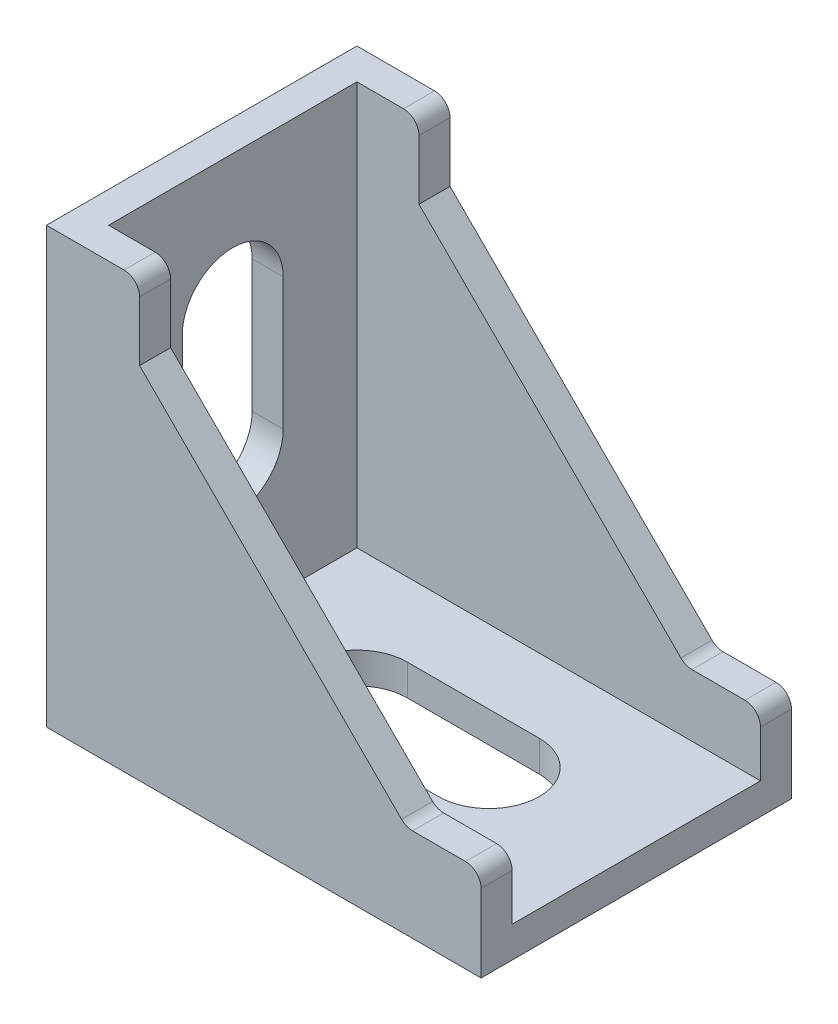
ISO-10303-21;
HEADER;
FILE_DESCRIPTION(('STEP AP214'),'2;1');
FILE_NAME('part.step','',(''),(''),'','','');
FILE_SCHEMA(('AUTOMOTIVE_DESIGN { 1 0 10303 214 1 1 1 1 }'));
ENDSEC;
DATA;
#1=APPLICATION_CONTEXT('core data for automotive mechanical design processes');
#2=APPLICATION_PROTOCOL_DEFINITION('international standard','automotive_design',2000,#1);
#3=PRODUCT_CONTEXT('',#1,'mechanical');
#4=PRODUCT('Part','Part','',(#3));
#5=PRODUCT_RELATED_PRODUCT_CATEGORY('part','',(#4));
#6=PRODUCT_DEFINITION_FORMATION('','',#4);
#7=PRODUCT_DEFINITION_CONTEXT('part definition',#1,'design');
#8=PRODUCT_DEFINITION('design','',#6,#7);
#9=PRODUCT_DEFINITION_SHAPE('','',#8);
#10=(LENGTH_UNIT() NAMED_UNIT(*) SI_UNIT(.MILLI.,.METRE.));
#11=(NAMED_UNIT(*) PLANE_ANGLE_UNIT() SI_UNIT($,.RADIAN.));
#12=(NAMED_UNIT(*) SI_UNIT($,.STERADIAN.) SOLID_ANGLE_UNIT());
#13=UNCERTAINTY_MEASURE_WITH_UNIT(LENGTH_MEASURE(1.E-05),#10,'distance_accuracy_value','');
#14=(GEOMETRIC_REPRESENTATION_CONTEXT(3) GLOBAL_UNCERTAINTY_ASSIGNED_CONTEXT((#13)) GLOBAL_UNIT_ASSIGNED_CONTEXT((#10,
#11,#12)) REPRESENTATION_CONTEXT('',''));
#15=CARTESIAN_POINT('',(0.,0.,0.));
#16=DIRECTION('',(0.,0.,1.));
#17=DIRECTION('',(1.,0.,0.));
#18=AXIS2_PLACEMENT_3D('',#15,#16,#17);
#19=CARTESIAN_POINT('',(23.1690140845071,6.,20.));
#20=DIRECTION('',(0.,-1.,0.));
#21=DIRECTION('',(0.,0.,-1.));
#22=AXIS2_PLACEMENT_3D('',#19,#20,#21);
#23=PLANE('',#22);
#24=DIRECTION('',(-1.,0.,0.));
#25=VECTOR('',#24,1.);
#26=CARTESIAN_POINT('',(23.1690140845071,6.,20.));
#27=LINE('',#26,#25);
#28=CARTESIAN_POINT('',(27.,6.,20.));
#29=VERTEX_POINT('',#28);
#30=CARTESIAN_POINT('',(23.5832276468801,6.,20.));
#31=VERTEX_POINT('',#30);
#32=EDGE_CURVE('E347',#29,#31,#27,.T.);
#33=ORIENTED_EDGE('',*,*,#32,.F.);
#34=DIRECTION('',(0.,0.,-1.));
#35=VECTOR('',#34,1.);
#36=CARTESIAN_POINT('',(27.,6.,20.));
#37=LINE('',#36,#35);
#38=CARTESIAN_POINT('',(27.,6.,18.));
#39=VERTEX_POINT('',#38);
#40=EDGE_CURVE('E406',#29,#39,#37,.T.);
#41=ORIENTED_EDGE('',*,*,#40,.T.);
#42=DIRECTION('',(-1.,0.,0.));
#43=VECTOR('',#42,1.);
#44=CARTESIAN_POINT('',(23.1690140845071,6.,18.));
#45=LINE('',#44,#43);
#46=CARTESIAN_POINT('',(23.5832276468801,6.,18.));
#47=VERTEX_POINT('',#46);
#48=EDGE_CURVE('E336',#39,#47,#45,.T.);
#49=ORIENTED_EDGE('',*,*,#48,.T.);
#50=DIRECTION('',(0.,0.,-1.));
#51=VECTOR('',#50,1.);
#52=CARTESIAN_POINT('',(23.5832276468801,6.,20.));
#53=LINE('',#52,#51);
#54=EDGE_CURVE('E404',#47,#31,#53,.F.);
#55=ORIENTED_EDGE('',*,*,#54,.T.);
#56=EDGE_LOOP('',(#33,#41,#49,#55));
#57=FACE_BOUND('',#56,.T.);
#58=ADVANCED_FACE('F36',(#57),#23,.F.);
#59=CARTESIAN_POINT('',(6.,23.169014084507,20.));
#60=DIRECTION('',(-0.707106781186546,-0.707106781186549,0.));
#61=DIRECTION('',(0.707106781186549,-0.707106781186546,0.));
#62=AXIS2_PLACEMENT_3D('',#59,#60,#61);
#63=PLANE('',#62);
#64=DIRECTION('',(-0.707106781186549,0.707106781186546,0.));
#65=VECTOR('',#64,1.);
#66=CARTESIAN_POINT('',(6.,23.169014084507,20.));
#67=LINE('',#66,#65);
#68=CARTESIAN_POINT('',(22.8761208656936,6.29289321881345,20.));
#69=VERTEX_POINT('',#68);
#70=CARTESIAN_POINT('',(6.,23.169014084507,20.));
#71=VERTEX_POINT('',#70);
#72=EDGE_CURVE('E350',#69,#71,#67,.T.);
#73=ORIENTED_EDGE('',*,*,#72,.F.);
#74=DIRECTION('',(0.,0.,-1.));
#75=VECTOR('',#74,1.);
#76=CARTESIAN_POINT('',(22.8761208656936,6.29289321881345,18.));
#77=LINE('',#76,#75);
#78=CARTESIAN_POINT('',(22.8761208656936,6.29289321881345,18.));
#79=VERTEX_POINT('',#78);
#80=EDGE_CURVE('E419',#69,#79,#77,.T.);
#81=ORIENTED_EDGE('',*,*,#80,.T.);
#82=DIRECTION('',(-0.707106781186549,0.707106781186546,0.));
#83=VECTOR('',#82,1.);
#84=CARTESIAN_POINT('',(6.,23.169014084507,18.));
#85=LINE('',#84,#83);
#86=CARTESIAN_POINT('',(6.,23.169014084507,18.));
#87=VERTEX_POINT('',#86);
#88=EDGE_CURVE('E334',#79,#87,#85,.T.);
#89=ORIENTED_EDGE('',*,*,#88,.T.);
#90=DIRECTION('',(0.,0.,-1.));
#91=VECTOR('',#90,1.);
#92=CARTESIAN_POINT('',(6.,23.169014084507,20.));
#93=LINE('',#92,#91);
#94=EDGE_CURVE('E381',#71,#87,#93,.T.);
#95=ORIENTED_EDGE('',*,*,#94,.F.);
#96=EDGE_LOOP('',(#73,#81,#89,#95));
#97=FACE_BOUND('',#96,.T.);
#98=ADVANCED_FACE('F451',(#97),#63,.F.);
#99=CARTESIAN_POINT('',(6.,28.,20.));
#100=DIRECTION('',(-1.,0.,0.));
#101=DIRECTION('',(0.,-1.,0.));
#102=AXIS2_PLACEMENT_3D('',#99,#100,#101);
#103=PLANE('',#102);
#104=DIRECTION('',(0.,1.,0.));
#105=VECTOR('',#104,1.);
#106=CARTESIAN_POINT('',(6.,28.,18.));
#107=LINE('',#106,#105);
#108=CARTESIAN_POINT('',(6.,27.,18.));
#109=VERTEX_POINT('',#108);
#110=EDGE_CURVE('E332',#87,#109,#107,.T.);
#111=ORIENTED_EDGE('',*,*,#110,.T.);
#112=DIRECTION('',(0.,0.,-1.));
#113=VECTOR('',#112,1.);
#114=CARTESIAN_POINT('',(6.,27.,20.));
#115=LINE('',#114,#113);
#116=CARTESIAN_POINT('',(6.,27.,20.));
#117=VERTEX_POINT('',#116);
#118=EDGE_CURVE('E59',#109,#117,#115,.F.);
#119=ORIENTED_EDGE('',*,*,#118,.T.);
#120=DIRECTION('',(0.,1.,0.));
#121=VECTOR('',#120,1.);
#122=CARTESIAN_POINT('',(6.,28.,20.));
#123=LINE('',#122,#121);
#124=EDGE_CURVE('E352',#71,#117,#123,.T.);
#125=ORIENTED_EDGE('',*,*,#124,.F.);
#126=ORIENTED_EDGE('',*,*,#94,.T.);
#127=EDGE_LOOP('',(#111,#119,#125,#126));
#128=FACE_BOUND('',#127,.T.);
#129=ADVANCED_FACE('F452',(#128),#103,.F.);
#130=CARTESIAN_POINT('',(28.,0.,20.));
#131=DIRECTION('',(0.,1.,0.));
#132=DIRECTION('',(0.,0.,1.));
#133=AXIS2_PLACEMENT_3D('',#130,#131,#132);
#134=PLANE('',#133);
#135=DIRECTION('',(1.,0.,0.));
#136=VECTOR('',#135,1.);
#137=CARTESIAN_POINT('',(10.,0.,6.75));
#138=LINE('',#137,#136);
#139=CARTESIAN_POINT('',(10.,0.,6.75));
#140=VERTEX_POINT('',#139);
#141=CARTESIAN_POINT('',(18.5,0.,6.75));
#142=VERTEX_POINT('',#141);
#143=EDGE_CURVE('E248',#140,#142,#138,.T.);
#144=ORIENTED_EDGE('',*,*,#143,.F.);
#145=CARTESIAN_POINT('',(10.,0.,9.99999999999999));
#146=DIRECTION('',(0.,1.,0.));
#147=DIRECTION('',(0.,0.,1.));
#148=AXIS2_PLACEMENT_3D('',#145,#146,#147);
#149=CIRCLE('',#148,3.25);
#150=CARTESIAN_POINT('',(10.,0.,13.25));
#151=VERTEX_POINT('',#150);
#152=EDGE_CURVE('E226',#151,#140,#149,.F.);
#153=ORIENTED_EDGE('',*,*,#152,.F.);
#154=DIRECTION('',(-1.,0.,0.));
#155=VECTOR('',#154,1.);
#156=CARTESIAN_POINT('',(10.,0.,13.25));
#157=LINE('',#156,#155);
#158=CARTESIAN_POINT('',(18.5,0.,13.25));
#159=VERTEX_POINT('',#158);
#160=EDGE_CURVE('E238',#159,#151,#157,.T.);
#161=ORIENTED_EDGE('',*,*,#160,.F.);
#162=CARTESIAN_POINT('',(18.5,0.,9.99999999999999));
#163=DIRECTION('',(0.,1.,0.));
#164=DIRECTION('',(0.,0.,1.));
#165=AXIS2_PLACEMENT_3D('',#162,#163,#164);
#166=CIRCLE('',#165,3.25);
#167=EDGE_CURVE('E252',#142,#159,#166,.F.);
#168=ORIENTED_EDGE('',*,*,#167,.F.);
#169=EDGE_LOOP('',(#144,#153,#161,#168));
#170=FACE_BOUND('',#169,.T.);
#171=DIRECTION('',(1.,0.,0.));
#172=VECTOR('',#171,1.);
#173=CARTESIAN_POINT('',(28.,0.,0.));
#174=LINE('',#173,#172);
#175=CARTESIAN_POINT('',(0.,0.,0.));
#176=VERTEX_POINT('',#175);
#177=CARTESIAN_POINT('',(28.,0.,0.));
#178=VERTEX_POINT('',#177);
#179=EDGE_CURVE('E339',#176,#178,#174,.T.);
#180=ORIENTED_EDGE('',*,*,#179,.T.);
#181=DIRECTION('',(0.,0.,-1.));
#182=VECTOR('',#181,1.);
#183=CARTESIAN_POINT('',(28.,0.,20.));
#184=LINE('',#183,#182);
#185=CARTESIAN_POINT('',(28.,0.,20.));
#186=VERTEX_POINT('',#185);
#187=EDGE_CURVE('E384',#186,#178,#184,.T.);
#188=ORIENTED_EDGE('',*,*,#187,.F.);
#189=DIRECTION('',(1.,0.,0.));
#190=VECTOR('',#189,1.);
#191=CARTESIAN_POINT('',(28.,0.,20.));
#192=LINE('',#191,#190);
#193=CARTESIAN_POINT('',(0.,0.,20.));
#194=VERTEX_POINT('',#193);
#195=EDGE_CURVE('E340',#194,#186,#192,.T.);
#196=ORIENTED_EDGE('',*,*,#195,.F.);
#197=DIRECTION('',(0.,0.,-1.));
#198=VECTOR('',#197,1.);
#199=CARTESIAN_POINT('',(0.,0.,20.));
#200=LINE('',#199,#198);
#201=EDGE_CURVE('E358',#194,#176,#200,.T.);
#202=ORIENTED_EDGE('',*,*,#201,.T.);
#203=EDGE_LOOP('',(#180,#188,#196,#202));
#204=FACE_BOUND('',#203,.T.);
#205=ADVANCED_FACE('F245',(#170,#204),#134,.F.);
#206=CARTESIAN_POINT('',(28.,6.,20.));
#207=DIRECTION('',(-1.,0.,0.));
#208=DIRECTION('',(0.,0.,1.));
#209=AXIS2_PLACEMENT_3D('',#206,#207,#208);
#210=PLANE('',#209);
#211=DIRECTION('',(0.,1.,0.));
#212=VECTOR('',#211,1.);
#213=CARTESIAN_POINT('',(28.,6.,0.));
#214=LINE('',#213,#212);
#215=CARTESIAN_POINT('',(28.,5.,0.));
#216=VERTEX_POINT('',#215);
#217=EDGE_CURVE('E361',#178,#216,#214,.T.);
#218=ORIENTED_EDGE('',*,*,#217,.T.);
#219=DIRECTION('',(0.,0.,-1.));
#220=VECTOR('',#219,1.);
#221=CARTESIAN_POINT('',(28.,5.,20.));
#222=LINE('',#221,#220);
#223=CARTESIAN_POINT('',(28.,5.,2.));
#224=VERTEX_POINT('',#223);
#225=EDGE_CURVE('E398',#216,#224,#222,.F.);
#226=ORIENTED_EDGE('',*,*,#225,.T.);
#227=DIRECTION('',(0.,1.,0.));
#228=VECTOR('',#227,1.);
#229=CARTESIAN_POINT('',(28.,28.,2.));
#230=LINE('',#229,#228);
#231=CARTESIAN_POINT('',(28.,2.,2.));
#232=VERTEX_POINT('',#231);
#233=EDGE_CURVE('E310',#232,#224,#230,.T.);
#234=ORIENTED_EDGE('',*,*,#233,.F.);
#235=DIRECTION('',(0.,0.,-1.));
#236=VECTOR('',#235,1.);
#237=CARTESIAN_POINT('',(28.,2.,2.));
#238=LINE('',#237,#236);
#239=CARTESIAN_POINT('',(28.,2.,18.));
#240=VERTEX_POINT('',#239);
#241=EDGE_CURVE('E307',#240,#232,#238,.T.);
#242=ORIENTED_EDGE('',*,*,#241,.F.);
#243=DIRECTION('',(0.,-1.,0.));
#244=VECTOR('',#243,1.);
#245=CARTESIAN_POINT('',(28.,28.,18.));
#246=LINE('',#245,#244);
#247=CARTESIAN_POINT('',(28.,5.,18.));
#248=VERTEX_POINT('',#247);
#249=EDGE_CURVE('E296',#248,#240,#246,.T.);
#250=ORIENTED_EDGE('',*,*,#249,.F.);
#251=DIRECTION('',(0.,0.,-1.));
#252=VECTOR('',#251,1.);
#253=CARTESIAN_POINT('',(28.,5.,20.));
#254=LINE('',#253,#252);
#255=CARTESIAN_POINT('',(28.,5.,20.));
#256=VERTEX_POINT('',#255);
#257=EDGE_CURVE('E396',#248,#256,#254,.F.);
#258=ORIENTED_EDGE('',*,*,#257,.T.);
#259=DIRECTION('',(0.,1.,0.));
#260=VECTOR('',#259,1.);
#261=CARTESIAN_POINT('',(28.,6.,20.));
#262=LINE('',#261,#260);
#263=EDGE_CURVE('E343',#186,#256,#262,.T.);
#264=ORIENTED_EDGE('',*,*,#263,.F.);
#265=ORIENTED_EDGE('',*,*,#187,.T.);
#266=EDGE_LOOP('',(#218,#226,#234,#242,#250,#258,#264,#265));
#267=FACE_BOUND('',#266,.T.);
#268=ADVANCED_FACE('F503',(#267),#210,.F.);
#269=DIRECTION('',(1.,0.,0.));
#270=VECTOR('',#269,1.);
#271=CARTESIAN_POINT('',(23.1690140845071,6.,2.));
#272=LINE('',#271,#270);
#273=CARTESIAN_POINT('',(23.5832276468801,6.,2.));
#274=VERTEX_POINT('',#273);
#275=CARTESIAN_POINT('',(27.,6.,2.));
#276=VERTEX_POINT('',#275);
#277=EDGE_CURVE('E329',#274,#276,#272,.T.);
#278=ORIENTED_EDGE('',*,*,#277,.T.);
#279=DIRECTION('',(0.,0.,-1.));
#280=VECTOR('',#279,1.);
#281=CARTESIAN_POINT('',(27.,6.,20.));
#282=LINE('',#281,#280);
#283=CARTESIAN_POINT('',(27.,6.,0.));
#284=VERTEX_POINT('',#283);
#285=EDGE_CURVE('E389',#276,#284,#282,.T.);
#286=ORIENTED_EDGE('',*,*,#285,.T.);
#287=DIRECTION('',(-1.,0.,0.));
#288=VECTOR('',#287,1.);
#289=CARTESIAN_POINT('',(23.1690140845071,6.,0.));
#290=LINE('',#289,#288);
#291=CARTESIAN_POINT('',(23.5832276468801,6.,0.));
#292=VERTEX_POINT('',#291);
#293=EDGE_CURVE('E364',#284,#292,#290,.T.);
#294=ORIENTED_EDGE('',*,*,#293,.T.);
#295=DIRECTION('',(0.,0.,-1.));
#296=VECTOR('',#295,1.);
#297=CARTESIAN_POINT('',(23.5832276468801,6.,2.));
#298=LINE('',#297,#296);
#299=EDGE_CURVE('E387',#292,#274,#298,.F.);
#300=ORIENTED_EDGE('',*,*,#299,.T.);
#301=EDGE_LOOP('',(#278,#286,#294,#300));
#302=FACE_BOUND('',#301,.T.);
#303=ADVANCED_FACE('F491',(#302),#23,.F.);
#304=DIRECTION('',(0.707106781186549,-0.707106781186546,0.));
#305=VECTOR('',#304,1.);
#306=CARTESIAN_POINT('',(6.,23.169014084507,2.));
#307=LINE('',#306,#305);
#308=CARTESIAN_POINT('',(6.,23.169014084507,2.));
#309=VERTEX_POINT('',#308);
#310=CARTESIAN_POINT('',(22.8761208656936,6.29289321881345,2.));
#311=VERTEX_POINT('',#310);
#312=EDGE_CURVE('E326',#309,#311,#307,.T.);
#313=ORIENTED_EDGE('',*,*,#312,.T.);
#314=DIRECTION('',(0.,0.,-1.));
#315=VECTOR('',#314,1.);
#316=CARTESIAN_POINT('',(22.8761208656936,6.29289321881345,0.));
#317=LINE('',#316,#315);
#318=CARTESIAN_POINT('',(22.8761208656936,6.29289321881345,0.));
#319=VERTEX_POINT('',#318);
#320=EDGE_CURVE('E416',#311,#319,#317,.T.);
#321=ORIENTED_EDGE('',*,*,#320,.T.);
#322=DIRECTION('',(-0.707106781186549,0.707106781186546,0.));
#323=VECTOR('',#322,1.);
#324=CARTESIAN_POINT('',(6.,23.169014084507,0.));
#325=LINE('',#324,#323);
#326=CARTESIAN_POINT('',(6.,23.169014084507,0.));
#327=VERTEX_POINT('',#326);
#328=EDGE_CURVE('E367',#319,#327,#325,.T.);
#329=ORIENTED_EDGE('',*,*,#328,.T.);
#330=EDGE_CURVE('E380',#309,#327,#93,.T.);
#331=ORIENTED_EDGE('',*,*,#330,.F.);
#332=EDGE_LOOP('',(#313,#321,#329,#331));
#333=FACE_BOUND('',#332,.T.);
#334=ADVANCED_FACE('F486',(#333),#63,.F.);
#335=DIRECTION('',(0.,1.,0.));
#336=VECTOR('',#335,1.);
#337=CARTESIAN_POINT('',(6.,28.,0.));
#338=LINE('',#337,#336);
#339=CARTESIAN_POINT('',(6.,27.,0.));
#340=VERTEX_POINT('',#339);
#341=EDGE_CURVE('E369',#327,#340,#338,.T.);
#342=ORIENTED_EDGE('',*,*,#341,.T.);
#343=DIRECTION('',(0.,0.,-1.));
#344=VECTOR('',#343,1.);
#345=CARTESIAN_POINT('',(6.,27.,20.));
#346=LINE('',#345,#344);
#347=CARTESIAN_POINT('',(6.,27.,2.));
#348=VERTEX_POINT('',#347);
#349=EDGE_CURVE('E428',#340,#348,#346,.F.);
#350=ORIENTED_EDGE('',*,*,#349,.T.);
#351=DIRECTION('',(0.,-1.,0.));
#352=VECTOR('',#351,1.);
#353=CARTESIAN_POINT('',(6.,28.,2.));
#354=LINE('',#353,#352);
#355=EDGE_CURVE('E324',#348,#309,#354,.T.);
#356=ORIENTED_EDGE('',*,*,#355,.T.);
#357=ORIENTED_EDGE('',*,*,#330,.T.);
#358=EDGE_LOOP('',(#342,#350,#356,#357));
#359=FACE_BOUND('',#358,.T.);
#360=ADVANCED_FACE('F481',(#359),#103,.F.);
#361=CARTESIAN_POINT('',(0.,28.,20.));
#362=DIRECTION('',(0.,-1.,0.));
#363=DIRECTION('',(0.,0.,-1.));
#364=AXIS2_PLACEMENT_3D('',#361,#362,#363);
#365=PLANE('',#364);
#366=DIRECTION('',(1.,0.,0.));
#367=VECTOR('',#366,1.);
#368=CARTESIAN_POINT('',(-30.5286750449475,28.,2.));
#369=LINE('',#368,#367);
#370=CARTESIAN_POINT('',(2.,28.,2.));
#371=VERTEX_POINT('',#370);
#372=CARTESIAN_POINT('',(5.,28.,2.));
#373=VERTEX_POINT('',#372);
#374=EDGE_CURVE('E316',#371,#373,#369,.T.);
#375=ORIENTED_EDGE('',*,*,#374,.T.);
#376=DIRECTION('',(0.,0.,-1.));
#377=VECTOR('',#376,1.);
#378=CARTESIAN_POINT('',(5.,28.,20.));
#379=LINE('',#378,#377);
#380=CARTESIAN_POINT('',(5.,28.,0.));
#381=VERTEX_POINT('',#380);
#382=EDGE_CURVE('E425',#373,#381,#379,.T.);
#383=ORIENTED_EDGE('',*,*,#382,.T.);
#384=DIRECTION('',(-1.,0.,0.));
#385=VECTOR('',#384,1.);
#386=CARTESIAN_POINT('',(0.,28.,0.));
#387=LINE('',#386,#385);
#388=CARTESIAN_POINT('',(0.,28.,0.));
#389=VERTEX_POINT('',#388);
#390=EDGE_CURVE('E372',#381,#389,#387,.T.);
#391=ORIENTED_EDGE('',*,*,#390,.T.);
#392=DIRECTION('',(0.,0.,-1.));
#393=VECTOR('',#392,1.);
#394=CARTESIAN_POINT('',(0.,28.,20.));
#395=LINE('',#394,#393);
#396=CARTESIAN_POINT('',(0.,28.,20.));
#397=VERTEX_POINT('',#396);
#398=EDGE_CURVE('E377',#397,#389,#395,.T.);
#399=ORIENTED_EDGE('',*,*,#398,.F.);
#400=DIRECTION('',(-1.,0.,0.));
#401=VECTOR('',#400,1.);
#402=CARTESIAN_POINT('',(0.,28.,20.));
#403=LINE('',#402,#401);
#404=CARTESIAN_POINT('',(5.,28.,20.));
#405=VERTEX_POINT('',#404);
#406=EDGE_CURVE('E354',#405,#397,#403,.T.);
#407=ORIENTED_EDGE('',*,*,#406,.F.);
#408=DIRECTION('',(0.,0.,-1.));
#409=VECTOR('',#408,1.);
#410=CARTESIAN_POINT('',(5.,28.,20.));
#411=LINE('',#410,#409);
#412=CARTESIAN_POINT('',(5.,28.,18.));
#413=VERTEX_POINT('',#412);
#414=EDGE_CURVE('E422',#405,#413,#411,.T.);
#415=ORIENTED_EDGE('',*,*,#414,.T.);
#416=DIRECTION('',(1.,0.,0.));
#417=VECTOR('',#416,1.);
#418=CARTESIAN_POINT('',(-30.5286750449475,28.,18.));
#419=LINE('',#418,#417);
#420=CARTESIAN_POINT('',(2.,28.,18.));
#421=VERTEX_POINT('',#420);
#422=EDGE_CURVE('E300',#421,#413,#419,.T.);
#423=ORIENTED_EDGE('',*,*,#422,.F.);
#424=DIRECTION('',(0.,0.,-1.));
#425=VECTOR('',#424,1.);
#426=CARTESIAN_POINT('',(2.,28.,2.));
#427=LINE('',#426,#425);
#428=EDGE_CURVE('E299',#421,#371,#427,.T.);
#429=ORIENTED_EDGE('',*,*,#428,.T.);
#430=EDGE_LOOP('',(#375,#383,#391,#399,#407,#415,#423,#429));
#431=FACE_BOUND('',#430,.T.);
#432=ADVANCED_FACE('F457',(#431),#365,.F.);
#433=CARTESIAN_POINT('',(0.,0.,20.));
#434=DIRECTION('',(1.,0.,0.));
#435=DIRECTION('',(0.,0.,-1.));
#436=AXIS2_PLACEMENT_3D('',#433,#434,#435);
#437=PLANE('',#436);
#438=DIRECTION('',(0.,1.,0.));
#439=VECTOR('',#438,1.);
#440=CARTESIAN_POINT('',(0.,11.,13.25));
#441=LINE('',#440,#439);
#442=CARTESIAN_POINT('',(0.,11.,13.25));
#443=VERTEX_POINT('',#442);
#444=CARTESIAN_POINT('',(0.,19.5,13.25));
#445=VERTEX_POINT('',#444);
#446=EDGE_CURVE('E267',#443,#445,#441,.T.);
#447=ORIENTED_EDGE('',*,*,#446,.F.);
#448=CARTESIAN_POINT('',(0.,11.,10.));
#449=DIRECTION('',(1.,0.,0.));
#450=DIRECTION('',(0.,0.,-1.));
#451=AXIS2_PLACEMENT_3D('',#448,#449,#450);
#452=CIRCLE('',#451,3.25);
#453=CARTESIAN_POINT('',(0.,11.,6.75));
#454=VERTEX_POINT('',#453);
#455=EDGE_CURVE('E270',#454,#443,#452,.F.);
#456=ORIENTED_EDGE('',*,*,#455,.F.);
#457=DIRECTION('',(0.,-1.,0.));
#458=VECTOR('',#457,1.);
#459=CARTESIAN_POINT('',(0.,11.,6.75));
#460=LINE('',#459,#458);
#461=CARTESIAN_POINT('',(0.,19.5,6.75));
#462=VERTEX_POINT('',#461);
#463=EDGE_CURVE('E287',#462,#454,#460,.T.);
#464=ORIENTED_EDGE('',*,*,#463,.F.);
#465=CARTESIAN_POINT('',(0.,19.5,10.));
#466=DIRECTION('',(1.,0.,0.));
#467=DIRECTION('',(0.,0.,-1.));
#468=AXIS2_PLACEMENT_3D('',#465,#466,#467);
#469=CIRCLE('',#468,3.25);
#470=EDGE_CURVE('E242',#445,#462,#469,.F.);
#471=ORIENTED_EDGE('',*,*,#470,.F.);
#472=EDGE_LOOP('',(#447,#456,#464,#471));
#473=FACE_BOUND('',#472,.T.);
#474=DIRECTION('',(0.,-1.,0.));
#475=VECTOR('',#474,1.);
#476=CARTESIAN_POINT('',(0.,0.,0.));
#477=LINE('',#476,#475);
#478=EDGE_CURVE('E344',#389,#176,#477,.T.);
#479=ORIENTED_EDGE('',*,*,#478,.T.);
#480=ORIENTED_EDGE('',*,*,#201,.F.);
#481=DIRECTION('',(0.,-1.,0.));
#482=VECTOR('',#481,1.);
#483=CARTESIAN_POINT('',(0.,0.,20.));
#484=LINE('',#483,#482);
#485=EDGE_CURVE('E356',#397,#194,#484,.T.);
#486=ORIENTED_EDGE('',*,*,#485,.F.);
#487=ORIENTED_EDGE('',*,*,#398,.T.);
#488=EDGE_LOOP('',(#479,#480,#486,#487));
#489=FACE_BOUND('',#488,.T.);
#490=ADVANCED_FACE('F509',(#473,#489),#437,.F.);
#491=CARTESIAN_POINT('',(0.,0.,20.));
#492=DIRECTION('',(0.,0.,-1.));
#493=DIRECTION('',(-1.,0.,0.));
#494=AXIS2_PLACEMENT_3D('',#491,#492,#493);
#495=PLANE('',#494);
#496=ORIENTED_EDGE('',*,*,#263,.T.);
#497=CARTESIAN_POINT('',(27.,5.,20.));
#498=DIRECTION('',(0.,0.,-1.));
#499=DIRECTION('',(-1.,0.,0.));
#500=AXIS2_PLACEMENT_3D('',#497,#498,#499);
#501=CIRCLE('',#500,1.);
#502=EDGE_CURVE('E414',#256,#29,#501,.F.);
#503=ORIENTED_EDGE('',*,*,#502,.T.);
#504=ORIENTED_EDGE('',*,*,#32,.T.);
#505=CARTESIAN_POINT('',(23.5832276468801,7.,20.));
#506=DIRECTION('',(0.,0.,-1.));
#507=DIRECTION('',(-1.,0.,0.));
#508=AXIS2_PLACEMENT_3D('',#505,#506,#507);
#509=CIRCLE('',#508,1.);
#510=EDGE_CURVE('E12',#31,#69,#509,.T.);
#511=ORIENTED_EDGE('',*,*,#510,.T.);
#512=ORIENTED_EDGE('',*,*,#72,.T.);
#513=ORIENTED_EDGE('',*,*,#124,.T.);
#514=CARTESIAN_POINT('',(5.,27.,20.));
#515=DIRECTION('',(0.,0.,-1.));
#516=DIRECTION('',(-1.,0.,0.));
#517=AXIS2_PLACEMENT_3D('',#514,#515,#516);
#518=CIRCLE('',#517,1.);
#519=EDGE_CURVE('E51',#117,#405,#518,.F.);
#520=ORIENTED_EDGE('',*,*,#519,.T.);
#521=ORIENTED_EDGE('',*,*,#406,.T.);
#522=ORIENTED_EDGE('',*,*,#485,.T.);
#523=ORIENTED_EDGE('',*,*,#195,.T.);
#524=EDGE_LOOP('',(#496,#503,#504,#511,#512,#513,#520,#521,#522,#523));
#525=FACE_BOUND('',#524,.T.);
#526=ADVANCED_FACE('F448',(#525),#495,.F.);
#527=CARTESIAN_POINT('',(0.,0.,0.));
#528=DIRECTION('',(0.,0.,-1.));
#529=DIRECTION('',(-1.,0.,0.));
#530=AXIS2_PLACEMENT_3D('',#527,#528,#529);
#531=PLANE('',#530);
#532=ORIENTED_EDGE('',*,*,#293,.F.);
#533=CARTESIAN_POINT('',(27.,5.,0.));
#534=DIRECTION('',(0.,0.,-1.));
#535=DIRECTION('',(-1.,0.,0.));
#536=AXIS2_PLACEMENT_3D('',#533,#534,#535);
#537=CIRCLE('',#536,1.);
#538=EDGE_CURVE('E394',#284,#216,#537,.T.);
#539=ORIENTED_EDGE('',*,*,#538,.T.);
#540=ORIENTED_EDGE('',*,*,#217,.F.);
#541=ORIENTED_EDGE('',*,*,#179,.F.);
#542=ORIENTED_EDGE('',*,*,#478,.F.);
#543=ORIENTED_EDGE('',*,*,#390,.F.);
#544=CARTESIAN_POINT('',(5.,27.,0.));
#545=DIRECTION('',(0.,0.,-1.));
#546=DIRECTION('',(-1.,0.,0.));
#547=AXIS2_PLACEMENT_3D('',#544,#545,#546);
#548=CIRCLE('',#547,1.);
#549=EDGE_CURVE('E392',#381,#340,#548,.T.);
#550=ORIENTED_EDGE('',*,*,#549,.T.);
#551=ORIENTED_EDGE('',*,*,#341,.F.);
#552=ORIENTED_EDGE('',*,*,#328,.F.);
#553=CARTESIAN_POINT('',(23.5832276468801,7.,0.));
#554=DIRECTION('',(0.,0.,-1.));
#555=DIRECTION('',(-1.,0.,0.));
#556=AXIS2_PLACEMENT_3D('',#553,#554,#555);
#557=CIRCLE('',#556,1.);
#558=EDGE_CURVE('E431',#319,#292,#557,.F.);
#559=ORIENTED_EDGE('',*,*,#558,.T.);
#560=EDGE_LOOP('',(#532,#539,#540,#541,#542,#543,#550,#551,#552,#559));
#561=FACE_BOUND('',#560,.T.);
#562=ADVANCED_FACE('F476',(#561),#531,.T.);
#563=CARTESIAN_POINT('',(-30.5286750449475,28.,18.));
#564=DIRECTION('',(0.,0.,1.));
#565=DIRECTION('',(0.,-1.,0.));
#566=AXIS2_PLACEMENT_3D('',#563,#564,#565);
#567=PLANE('',#566);
#568=ORIENTED_EDGE('',*,*,#48,.F.);
#569=CARTESIAN_POINT('',(27.,5.,18.));
#570=DIRECTION('',(0.,0.,1.));
#571=DIRECTION('',(0.,-1.,0.));
#572=AXIS2_PLACEMENT_3D('',#569,#570,#571);
#573=CIRCLE('',#572,1.);
#574=EDGE_CURVE('E411',#39,#248,#573,.F.);
#575=ORIENTED_EDGE('',*,*,#574,.T.);
#576=ORIENTED_EDGE('',*,*,#249,.T.);
#577=DIRECTION('',(1.,0.,0.));
#578=VECTOR('',#577,1.);
#579=CARTESIAN_POINT('',(-30.5286750449475,2.,18.));
#580=LINE('',#579,#578);
#581=CARTESIAN_POINT('',(2.,2.,18.));
#582=VERTEX_POINT('',#581);
#583=EDGE_CURVE('E313',#582,#240,#580,.T.);
#584=ORIENTED_EDGE('',*,*,#583,.F.);
#585=DIRECTION('',(0.,1.,0.));
#586=VECTOR('',#585,1.);
#587=CARTESIAN_POINT('',(2.,28.,18.));
#588=LINE('',#587,#586);
#589=EDGE_CURVE('E303',#582,#421,#588,.T.);
#590=ORIENTED_EDGE('',*,*,#589,.T.);
#591=ORIENTED_EDGE('',*,*,#422,.T.);
#592=CARTESIAN_POINT('',(5.,27.,18.));
#593=DIRECTION('',(0.,0.,1.));
#594=DIRECTION('',(0.,-1.,0.));
#595=AXIS2_PLACEMENT_3D('',#592,#593,#594);
#596=CIRCLE('',#595,1.);
#597=EDGE_CURVE('E409',#413,#109,#596,.F.);
#598=ORIENTED_EDGE('',*,*,#597,.T.);
#599=ORIENTED_EDGE('',*,*,#110,.F.);
#600=ORIENTED_EDGE('',*,*,#88,.F.);
#601=CARTESIAN_POINT('',(23.5832276468801,7.,18.));
#602=DIRECTION('',(0.,0.,1.));
#603=DIRECTION('',(0.,-1.,0.));
#604=AXIS2_PLACEMENT_3D('',#601,#602,#603);
#605=CIRCLE('',#604,1.);
#606=EDGE_CURVE('E44',#79,#47,#605,.T.);
#607=ORIENTED_EDGE('',*,*,#606,.T.);
#608=EDGE_LOOP('',(#568,#575,#576,#584,#590,#591,#598,#599,#600,#607));
#609=FACE_BOUND('',#608,.T.);
#610=ADVANCED_FACE('F437',(#609),#567,.F.);
#611=CARTESIAN_POINT('',(-30.5286750449475,28.,2.));
#612=DIRECTION('',(0.,0.,-1.));
#613=DIRECTION('',(0.,1.,0.));
#614=AXIS2_PLACEMENT_3D('',#611,#612,#613);
#615=PLANE('',#614);
#616=ORIENTED_EDGE('',*,*,#233,.T.);
#617=CARTESIAN_POINT('',(27.,5.,2.));
#618=DIRECTION('',(0.,0.,-1.));
#619=DIRECTION('',(0.,1.,0.));
#620=AXIS2_PLACEMENT_3D('',#617,#618,#619);
#621=CIRCLE('',#620,1.);
#622=EDGE_CURVE('E402',#224,#276,#621,.F.);
#623=ORIENTED_EDGE('',*,*,#622,.T.);
#624=ORIENTED_EDGE('',*,*,#277,.F.);
#625=CARTESIAN_POINT('',(23.5832276468801,7.,2.));
#626=DIRECTION('',(0.,0.,-1.));
#627=DIRECTION('',(0.,1.,0.));
#628=AXIS2_PLACEMENT_3D('',#625,#626,#627);
#629=CIRCLE('',#628,1.);
#630=EDGE_CURVE('E433',#274,#311,#629,.T.);
#631=ORIENTED_EDGE('',*,*,#630,.T.);
#632=ORIENTED_EDGE('',*,*,#312,.F.);
#633=ORIENTED_EDGE('',*,*,#355,.F.);
#634=CARTESIAN_POINT('',(5.,27.,2.));
#635=DIRECTION('',(0.,0.,-1.));
#636=DIRECTION('',(0.,1.,0.));
#637=AXIS2_PLACEMENT_3D('',#634,#635,#636);
#638=CIRCLE('',#637,1.);
#639=EDGE_CURVE('E400',#348,#373,#638,.F.);
#640=ORIENTED_EDGE('',*,*,#639,.T.);
#641=ORIENTED_EDGE('',*,*,#374,.F.);
#642=DIRECTION('',(0.,-1.,0.));
#643=VECTOR('',#642,1.);
#644=CARTESIAN_POINT('',(2.,28.,2.));
#645=LINE('',#644,#643);
#646=CARTESIAN_POINT('',(2.,2.,2.));
#647=VERTEX_POINT('',#646);
#648=EDGE_CURVE('E297',#371,#647,#645,.T.);
#649=ORIENTED_EDGE('',*,*,#648,.T.);
#650=DIRECTION('',(1.,0.,0.));
#651=VECTOR('',#650,1.);
#652=CARTESIAN_POINT('',(-30.5286750449475,2.,2.));
#653=LINE('',#652,#651);
#654=EDGE_CURVE('E319',#647,#232,#653,.T.);
#655=ORIENTED_EDGE('',*,*,#654,.T.);
#656=EDGE_LOOP('',(#616,#623,#624,#631,#632,#633,#640,#641,#649,#655));
#657=FACE_BOUND('',#656,.T.);
#658=ADVANCED_FACE('F496',(#657),#615,.F.);
#659=CARTESIAN_POINT('',(-30.5286750449475,2.,2.));
#660=DIRECTION('',(0.,-1.,0.));
#661=DIRECTION('',(0.,0.,-1.));
#662=AXIS2_PLACEMENT_3D('',#659,#660,#661);
#663=PLANE('',#662);
#664=DIRECTION('',(1.,0.,0.));
#665=VECTOR('',#664,1.);
#666=CARTESIAN_POINT('',(10.,2.,13.25));
#667=LINE('',#666,#665);
#668=CARTESIAN_POINT('',(10.,2.,13.25));
#669=VERTEX_POINT('',#668);
#670=CARTESIAN_POINT('',(18.5,2.,13.25));
#671=VERTEX_POINT('',#670);
#672=EDGE_CURVE('E250',#669,#671,#667,.T.);
#673=ORIENTED_EDGE('',*,*,#672,.F.);
#674=CARTESIAN_POINT('',(10.,2.,9.99999999999999));
#675=DIRECTION('',(0.,1.,0.));
#676=DIRECTION('',(0.,0.,1.));
#677=AXIS2_PLACEMENT_3D('',#674,#675,#676);
#678=CIRCLE('',#677,3.25);
#679=CARTESIAN_POINT('',(10.,2.,6.75));
#680=VERTEX_POINT('',#679);
#681=EDGE_CURVE('E229',#680,#669,#678,.T.);
#682=ORIENTED_EDGE('',*,*,#681,.F.);
#683=DIRECTION('',(-1.,0.,0.));
#684=VECTOR('',#683,1.);
#685=CARTESIAN_POINT('',(10.,2.,6.75));
#686=LINE('',#685,#684);
#687=CARTESIAN_POINT('',(18.5,2.,6.75));
#688=VERTEX_POINT('',#687);
#689=EDGE_CURVE('E234',#688,#680,#686,.T.);
#690=ORIENTED_EDGE('',*,*,#689,.F.);
#691=CARTESIAN_POINT('',(18.5,2.,9.99999999999999));
#692=DIRECTION('',(0.,1.,0.));
#693=DIRECTION('',(0.,0.,1.));
#694=AXIS2_PLACEMENT_3D('',#691,#692,#693);
#695=CIRCLE('',#694,3.25);
#696=EDGE_CURVE('E257',#671,#688,#695,.T.);
#697=ORIENTED_EDGE('',*,*,#696,.F.);
#698=EDGE_LOOP('',(#673,#682,#690,#697));
#699=FACE_BOUND('',#698,.T.);
#700=DIRECTION('',(0.,0.,1.));
#701=VECTOR('',#700,1.);
#702=CARTESIAN_POINT('',(2.,2.,2.));
#703=LINE('',#702,#701);
#704=EDGE_CURVE('E305',#647,#582,#703,.T.);
#705=ORIENTED_EDGE('',*,*,#704,.T.);
#706=ORIENTED_EDGE('',*,*,#583,.T.);
#707=ORIENTED_EDGE('',*,*,#241,.T.);
#708=ORIENTED_EDGE('',*,*,#654,.F.);
#709=EDGE_LOOP('',(#705,#706,#707,#708));
#710=FACE_BOUND('',#709,.T.);
#711=ADVANCED_FACE('F519',(#699,#710),#663,.F.);
#712=CARTESIAN_POINT('',(2.,0.,20.));
#713=DIRECTION('',(1.,0.,0.));
#714=DIRECTION('',(0.,0.,-1.));
#715=AXIS2_PLACEMENT_3D('',#712,#713,#714);
#716=PLANE('',#715);
#717=CARTESIAN_POINT('',(2.,11.,10.));
#718=DIRECTION('',(1.,0.,0.));
#719=DIRECTION('',(0.,0.,-1.));
#720=AXIS2_PLACEMENT_3D('',#717,#718,#719);
#721=CIRCLE('',#720,3.25);
#722=CARTESIAN_POINT('',(2.,11.,13.25));
#723=VERTEX_POINT('',#722);
#724=CARTESIAN_POINT('',(2.,11.,6.75));
#725=VERTEX_POINT('',#724);
#726=EDGE_CURVE('E273',#723,#725,#721,.T.);
#727=ORIENTED_EDGE('',*,*,#726,.F.);
#728=DIRECTION('',(0.,-1.,0.));
#729=VECTOR('',#728,1.);
#730=CARTESIAN_POINT('',(2.,11.,13.25));
#731=LINE('',#730,#729);
#732=CARTESIAN_POINT('',(2.,19.5,13.25));
#733=VERTEX_POINT('',#732);
#734=EDGE_CURVE('E281',#733,#723,#731,.T.);
#735=ORIENTED_EDGE('',*,*,#734,.F.);
#736=CARTESIAN_POINT('',(2.,19.5,10.));
#737=DIRECTION('',(1.,0.,0.));
#738=DIRECTION('',(0.,0.,-1.));
#739=AXIS2_PLACEMENT_3D('',#736,#737,#738);
#740=CIRCLE('',#739,3.25);
#741=CARTESIAN_POINT('',(2.,19.5,6.75));
#742=VERTEX_POINT('',#741);
#743=EDGE_CURVE('E278',#742,#733,#740,.T.);
#744=ORIENTED_EDGE('',*,*,#743,.F.);
#745=DIRECTION('',(0.,1.,0.));
#746=VECTOR('',#745,1.);
#747=CARTESIAN_POINT('',(2.,11.,6.75));
#748=LINE('',#747,#746);
#749=EDGE_CURVE('E275',#725,#742,#748,.T.);
#750=ORIENTED_EDGE('',*,*,#749,.F.);
#751=EDGE_LOOP('',(#727,#735,#744,#750));
#752=FACE_BOUND('',#751,.T.);
#753=ORIENTED_EDGE('',*,*,#589,.F.);
#754=ORIENTED_EDGE('',*,*,#704,.F.);
#755=ORIENTED_EDGE('',*,*,#648,.F.);
#756=ORIENTED_EDGE('',*,*,#428,.F.);
#757=EDGE_LOOP('',(#753,#754,#755,#756));
#758=FACE_BOUND('',#757,.T.);
#759=ADVANCED_FACE('F465',(#752,#758),#716,.T.);
#760=CARTESIAN_POINT('',(-0.00100000000000013,11.,10.));
#761=DIRECTION('',(1.,0.,0.));
#762=DIRECTION('',(0.,0.,-1.));
#763=AXIS2_PLACEMENT_3D('',#760,#761,#762);
#764=CYLINDRICAL_SURFACE('',#763,3.25);
#765=ORIENTED_EDGE('',*,*,#455,.T.);
#766=DIRECTION('',(1.,0.,0.));
#767=VECTOR('',#766,1.);
#768=CARTESIAN_POINT('',(-0.00100000000000013,11.,13.25));
#769=LINE('',#768,#767);
#770=EDGE_CURVE('E285',#443,#723,#769,.T.);
#771=ORIENTED_EDGE('',*,*,#770,.T.);
#772=ORIENTED_EDGE('',*,*,#726,.T.);
#773=DIRECTION('',(1.,0.,0.));
#774=VECTOR('',#773,1.);
#775=CARTESIAN_POINT('',(-0.00100000000000013,11.,6.75));
#776=LINE('',#775,#774);
#777=EDGE_CURVE('E284',#454,#725,#776,.T.);
#778=ORIENTED_EDGE('',*,*,#777,.F.);
#779=EDGE_LOOP('',(#765,#771,#772,#778));
#780=FACE_BOUND('',#779,.T.);
#781=ADVANCED_FACE('F527',(#780),#764,.F.);
#782=CARTESIAN_POINT('',(-0.00100000000000013,11.,13.25));
#783=DIRECTION('',(0.,0.,1.));
#784=DIRECTION('',(1.,0.,0.));
#785=AXIS2_PLACEMENT_3D('',#782,#783,#784);
#786=PLANE('',#785);
#787=ORIENTED_EDGE('',*,*,#446,.T.);
#788=DIRECTION('',(1.,0.,0.));
#789=VECTOR('',#788,1.);
#790=CARTESIAN_POINT('',(-0.00100000000000013,19.5,13.25));
#791=LINE('',#790,#789);
#792=EDGE_CURVE('E288',#445,#733,#791,.T.);
#793=ORIENTED_EDGE('',*,*,#792,.T.);
#794=ORIENTED_EDGE('',*,*,#734,.T.);
#795=ORIENTED_EDGE('',*,*,#770,.F.);
#796=EDGE_LOOP('',(#787,#793,#794,#795));
#797=FACE_BOUND('',#796,.T.);
#798=ADVANCED_FACE('F678',(#797),#786,.F.);
#799=CARTESIAN_POINT('',(-0.00100000000000013,19.5,10.));
#800=DIRECTION('',(1.,0.,0.));
#801=DIRECTION('',(0.,0.,-1.));
#802=AXIS2_PLACEMENT_3D('',#799,#800,#801);
#803=CYLINDRICAL_SURFACE('',#802,3.25);
#804=ORIENTED_EDGE('',*,*,#470,.T.);
#805=DIRECTION('',(1.,0.,0.));
#806=VECTOR('',#805,1.);
#807=CARTESIAN_POINT('',(-0.00100000000000013,19.5,6.75));
#808=LINE('',#807,#806);
#809=EDGE_CURVE('E290',#462,#742,#808,.T.);
#810=ORIENTED_EDGE('',*,*,#809,.T.);
#811=ORIENTED_EDGE('',*,*,#743,.T.);
#812=ORIENTED_EDGE('',*,*,#792,.F.);
#813=EDGE_LOOP('',(#804,#810,#811,#812));
#814=FACE_BOUND('',#813,.T.);
#815=ADVANCED_FACE('F688',(#814),#803,.F.);
#816=CARTESIAN_POINT('',(-0.00100000000000013,11.,6.75));
#817=DIRECTION('',(0.,0.,-1.));
#818=DIRECTION('',(-1.,0.,0.));
#819=AXIS2_PLACEMENT_3D('',#816,#817,#818);
#820=PLANE('',#819);
#821=ORIENTED_EDGE('',*,*,#463,.T.);
#822=ORIENTED_EDGE('',*,*,#777,.T.);
#823=ORIENTED_EDGE('',*,*,#749,.T.);
#824=ORIENTED_EDGE('',*,*,#809,.F.);
#825=EDGE_LOOP('',(#821,#822,#823,#824));
#826=FACE_BOUND('',#825,.T.);
#827=ADVANCED_FACE('F698',(#826),#820,.F.);
#828=CARTESIAN_POINT('',(10.,-0.00100000000000143,9.99999999999999));
#829=DIRECTION('',(0.,1.,0.));
#830=DIRECTION('',(0.,0.,1.));
#831=AXIS2_PLACEMENT_3D('',#828,#829,#830);
#832=CYLINDRICAL_SURFACE('',#831,3.25);
#833=ORIENTED_EDGE('',*,*,#152,.T.);
#834=DIRECTION('',(0.,1.,0.));
#835=VECTOR('',#834,1.);
#836=CARTESIAN_POINT('',(10.,-0.001000000000001,6.75));
#837=LINE('',#836,#835);
#838=EDGE_CURVE('E243',#140,#680,#837,.T.);
#839=ORIENTED_EDGE('',*,*,#838,.T.);
#840=ORIENTED_EDGE('',*,*,#681,.T.);
#841=DIRECTION('',(0.,1.,0.));
#842=VECTOR('',#841,1.);
#843=CARTESIAN_POINT('',(10.,-0.0010000000000023,13.25));
#844=LINE('',#843,#842);
#845=EDGE_CURVE('E222',#151,#669,#844,.T.);
#846=ORIENTED_EDGE('',*,*,#845,.F.);
#847=EDGE_LOOP('',(#833,#839,#840,#846));
#848=FACE_BOUND('',#847,.T.);
#849=ADVANCED_FACE('F224',(#848),#832,.F.);
#850=CARTESIAN_POINT('',(10.,-0.001000000000001,6.75));
#851=DIRECTION('',(0.,0.,-1.));
#852=DIRECTION('',(0.,1.,0.));
#853=AXIS2_PLACEMENT_3D('',#850,#851,#852);
#854=PLANE('',#853);
#855=ORIENTED_EDGE('',*,*,#143,.T.);
#856=DIRECTION('',(0.,1.,0.));
#857=VECTOR('',#856,1.);
#858=CARTESIAN_POINT('',(18.5,-0.001000000000001,6.75));
#859=LINE('',#858,#857);
#860=EDGE_CURVE('E263',#142,#688,#859,.T.);
#861=ORIENTED_EDGE('',*,*,#860,.T.);
#862=ORIENTED_EDGE('',*,*,#689,.T.);
#863=ORIENTED_EDGE('',*,*,#838,.F.);
#864=EDGE_LOOP('',(#855,#861,#862,#863));
#865=FACE_BOUND('',#864,.T.);
#866=ADVANCED_FACE('F715',(#865),#854,.F.);
#867=CARTESIAN_POINT('',(18.5,-0.00100000000000143,9.99999999999999));
#868=DIRECTION('',(0.,1.,0.));
#869=DIRECTION('',(0.,0.,1.));
#870=AXIS2_PLACEMENT_3D('',#867,#868,#869);
#871=CYLINDRICAL_SURFACE('',#870,3.25);
#872=ORIENTED_EDGE('',*,*,#167,.T.);
#873=DIRECTION('',(0.,1.,0.));
#874=VECTOR('',#873,1.);
#875=CARTESIAN_POINT('',(18.5,-0.00100000000000187,13.25));
#876=LINE('',#875,#874);
#877=EDGE_CURVE('E233',#159,#671,#876,.T.);
#878=ORIENTED_EDGE('',*,*,#877,.T.);
#879=ORIENTED_EDGE('',*,*,#696,.T.);
#880=ORIENTED_EDGE('',*,*,#860,.F.);
#881=EDGE_LOOP('',(#872,#878,#879,#880));
#882=FACE_BOUND('',#881,.T.);
#883=ADVANCED_FACE('F724',(#882),#871,.F.);
#884=CARTESIAN_POINT('',(10.,-0.0010000000000023,13.25));
#885=DIRECTION('',(0.,0.,1.));
#886=DIRECTION('',(0.,-1.,0.));
#887=AXIS2_PLACEMENT_3D('',#884,#885,#886);
#888=PLANE('',#887);
#889=ORIENTED_EDGE('',*,*,#160,.T.);
#890=ORIENTED_EDGE('',*,*,#845,.T.);
#891=ORIENTED_EDGE('',*,*,#672,.T.);
#892=ORIENTED_EDGE('',*,*,#877,.F.);
#893=EDGE_LOOP('',(#889,#890,#891,#892));
#894=FACE_BOUND('',#893,.T.);
#895=ADVANCED_FACE('F239',(#894),#888,.F.);
#896=CARTESIAN_POINT('',(27.,5.,20.));
#897=DIRECTION('',(0.,0.,-1.));
#898=DIRECTION('',(-1.,0.,0.));
#899=AXIS2_PLACEMENT_3D('',#896,#897,#898);
#900=CYLINDRICAL_SURFACE('',#899,1.);
#901=ORIENTED_EDGE('',*,*,#622,.F.);
#902=ORIENTED_EDGE('',*,*,#225,.F.);
#903=ORIENTED_EDGE('',*,*,#538,.F.);
#904=ORIENTED_EDGE('',*,*,#285,.F.);
#905=EDGE_LOOP('',(#901,#902,#903,#904));
#906=FACE_BOUND('',#905,.T.);
#907=ADVANCED_FACE('F499',(#906),#900,.T.);
#908=CARTESIAN_POINT('',(27.,5.,20.));
#909=DIRECTION('',(0.,0.,-1.));
#910=DIRECTION('',(-1.,0.,0.));
#911=AXIS2_PLACEMENT_3D('',#908,#909,#910);
#912=CYLINDRICAL_SURFACE('',#911,1.);
#913=ORIENTED_EDGE('',*,*,#502,.F.);
#914=ORIENTED_EDGE('',*,*,#257,.F.);
#915=ORIENTED_EDGE('',*,*,#574,.F.);
#916=ORIENTED_EDGE('',*,*,#40,.F.);
#917=EDGE_LOOP('',(#913,#914,#915,#916));
#918=FACE_BOUND('',#917,.T.);
#919=ADVANCED_FACE('F514',(#918),#912,.T.);
#920=CARTESIAN_POINT('',(23.5832276468801,7.,20.));
#921=DIRECTION('',(0.,0.,1.));
#922=DIRECTION('',(1.,0.,0.));
#923=AXIS2_PLACEMENT_3D('',#920,#921,#922);
#924=CYLINDRICAL_SURFACE('',#923,1.);
#925=ORIENTED_EDGE('',*,*,#630,.F.);
#926=ORIENTED_EDGE('',*,*,#299,.F.);
#927=ORIENTED_EDGE('',*,*,#558,.F.);
#928=ORIENTED_EDGE('',*,*,#320,.F.);
#929=EDGE_LOOP('',(#925,#926,#927,#928));
#930=FACE_BOUND('',#929,.T.);
#931=ADVANCED_FACE('F495',(#930),#924,.F.);
#932=CARTESIAN_POINT('',(23.5832276468801,7.,20.));
#933=DIRECTION('',(0.,0.,1.));
#934=DIRECTION('',(1.,0.,0.));
#935=AXIS2_PLACEMENT_3D('',#932,#933,#934);
#936=CYLINDRICAL_SURFACE('',#935,1.);
#937=ORIENTED_EDGE('',*,*,#510,.F.);
#938=ORIENTED_EDGE('',*,*,#54,.F.);
#939=ORIENTED_EDGE('',*,*,#606,.F.);
#940=ORIENTED_EDGE('',*,*,#80,.F.);
#941=EDGE_LOOP('',(#937,#938,#939,#940));
#942=FACE_BOUND('',#941,.T.);
#943=ADVANCED_FACE('F446',(#942),#936,.F.);
#944=CARTESIAN_POINT('',(5.,27.,20.));
#945=DIRECTION('',(0.,0.,-1.));
#946=DIRECTION('',(-1.,0.,0.));
#947=AXIS2_PLACEMENT_3D('',#944,#945,#946);
#948=CYLINDRICAL_SURFACE('',#947,1.);
#949=ORIENTED_EDGE('',*,*,#639,.F.);
#950=ORIENTED_EDGE('',*,*,#349,.F.);
#951=ORIENTED_EDGE('',*,*,#549,.F.);
#952=ORIENTED_EDGE('',*,*,#382,.F.);
#953=EDGE_LOOP('',(#949,#950,#951,#952));
#954=FACE_BOUND('',#953,.T.);
#955=ADVANCED_FACE('F471',(#954),#948,.T.);
#956=CARTESIAN_POINT('',(5.,27.,20.));
#957=DIRECTION('',(0.,0.,-1.));
#958=DIRECTION('',(-1.,0.,0.));
#959=AXIS2_PLACEMENT_3D('',#956,#957,#958);
#960=CYLINDRICAL_SURFACE('',#959,1.);
#961=ORIENTED_EDGE('',*,*,#519,.F.);
#962=ORIENTED_EDGE('',*,*,#118,.F.);
#963=ORIENTED_EDGE('',*,*,#597,.F.);
#964=ORIENTED_EDGE('',*,*,#414,.F.);
#965=EDGE_LOOP('',(#961,#962,#963,#964));
#966=FACE_BOUND('',#965,.T.);
#967=ADVANCED_FACE('F38',(#966),#960,.T.);
#968=CLOSED_SHELL('',(#58,#98,#129,#205,#268,#303,#334,#360,#432,#490,#526,#562,#610,#658,#711,
#759,#781,#798,#815,#827,#849,#866,#883,#895,#907,#919,#931,#943,#955,#967));
#969=MANIFOLD_SOLID_BREP('B2',#968);
#970=ADVANCED_BREP_SHAPE_REPRESENTATION('',(#18,#969),#14);
#971=SHAPE_DEFINITION_REPRESENTATION(#9,#970);
ENDSEC;
END-ISO-10303-21;
